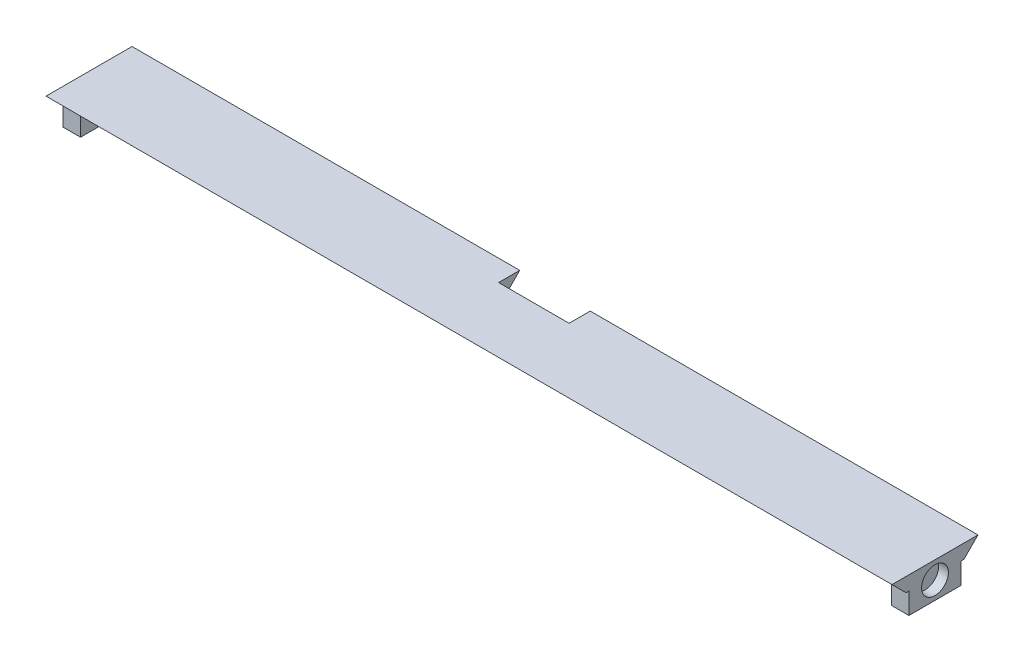
ISO-10303-21;
HEADER;
FILE_DESCRIPTION(('STEP AP214'),'2;1');
FILE_NAME('part.step','',(''),(''),'','','');
FILE_SCHEMA(('AUTOMOTIVE_DESIGN { 1 0 10303 214 1 1 1 1 }'));
ENDSEC;
DATA;
#1=APPLICATION_CONTEXT('core data for automotive mechanical design processes');
#2=APPLICATION_PROTOCOL_DEFINITION('international standard','automotive_design',2000,#1);
#3=PRODUCT_CONTEXT('',#1,'mechanical');
#4=PRODUCT('Part','Part','',(#3));
#5=PRODUCT_RELATED_PRODUCT_CATEGORY('part','',(#4));
#6=PRODUCT_DEFINITION_FORMATION('','',#4);
#7=PRODUCT_DEFINITION_CONTEXT('part definition',#1,'design');
#8=PRODUCT_DEFINITION('design','',#6,#7);
#9=PRODUCT_DEFINITION_SHAPE('','',#8);
#10=(LENGTH_UNIT() NAMED_UNIT(*) SI_UNIT(.MILLI.,.METRE.));
#11=(NAMED_UNIT(*) PLANE_ANGLE_UNIT() SI_UNIT($,.RADIAN.));
#12=(NAMED_UNIT(*) SI_UNIT($,.STERADIAN.) SOLID_ANGLE_UNIT());
#13=UNCERTAINTY_MEASURE_WITH_UNIT(LENGTH_MEASURE(1.E-05),#10,'distance_accuracy_value','');
#14=(GEOMETRIC_REPRESENTATION_CONTEXT(3) GLOBAL_UNCERTAINTY_ASSIGNED_CONTEXT((#13)) GLOBAL_UNIT_ASSIGNED_CONTEXT((#10,
#11,#12)) REPRESENTATION_CONTEXT('',''));
#15=CARTESIAN_POINT('',(0.,0.,0.));
#16=DIRECTION('',(0.,0.,1.));
#17=DIRECTION('',(1.,0.,0.));
#18=AXIS2_PLACEMENT_3D('',#15,#16,#17);
#19=CARTESIAN_POINT('',(0.,0.,0.));
#20=DIRECTION('',(0.,1.,0.));
#21=DIRECTION('',(0.,0.,1.));
#22=AXIS2_PLACEMENT_3D('',#19,#20,#21);
#23=PLANE('',#22);
#24=DIRECTION('',(1.,0.,0.));
#25=VECTOR('',#24,1.);
#26=CARTESIAN_POINT('',(0.,0.,-9.8));
#27=LINE('',#26,#25);
#28=CARTESIAN_POINT('',(0.,0.,-9.8));
#29=VERTEX_POINT('',#28);
#30=CARTESIAN_POINT('',(2.5,0.,-9.8));
#31=VERTEX_POINT('',#30);
#32=EDGE_CURVE('E482',#29,#31,#27,.T.);
#33=ORIENTED_EDGE('',*,*,#32,.F.);
#34=DIRECTION('',(0.,0.,-1.));
#35=VECTOR('',#34,1.);
#36=CARTESIAN_POINT('',(0.,0.,0.));
#37=LINE('',#36,#35);
#38=CARTESIAN_POINT('',(0.,0.,-10.2));
#39=VERTEX_POINT('',#38);
#40=EDGE_CURVE('E178',#29,#39,#37,.T.);
#41=ORIENTED_EDGE('',*,*,#40,.T.);
#42=DIRECTION('',(1.,0.,0.));
#43=VECTOR('',#42,1.);
#44=CARTESIAN_POINT('',(55.,0.,-10.2));
#45=LINE('',#44,#43);
#46=CARTESIAN_POINT('',(55.,0.,-10.2));
#47=VERTEX_POINT('',#46);
#48=EDGE_CURVE('E255',#39,#47,#45,.T.);
#49=ORIENTED_EDGE('',*,*,#48,.T.);
#50=DIRECTION('',(0.,0.,-1.));
#51=VECTOR('',#50,1.);
#52=CARTESIAN_POINT('',(55.,0.,1.27213054904966E-13));
#53=LINE('',#52,#51);
#54=CARTESIAN_POINT('',(55.,0.,-7.19999999999999));
#55=VERTEX_POINT('',#54);
#56=EDGE_CURVE('E214',#55,#47,#53,.T.);
#57=ORIENTED_EDGE('',*,*,#56,.F.);
#58=DIRECTION('',(1.,0.,0.));
#59=VECTOR('',#58,1.);
#60=CARTESIAN_POINT('',(0.,0.,-7.19999999999998));
#61=LINE('',#60,#59);
#62=CARTESIAN_POINT('',(65.,0.,-7.2));
#63=VERTEX_POINT('',#62);
#64=EDGE_CURVE('E252',#55,#63,#61,.T.);
#65=ORIENTED_EDGE('',*,*,#64,.T.);
#66=DIRECTION('',(0.,0.,-1.));
#67=VECTOR('',#66,1.);
#68=CARTESIAN_POINT('',(65.,0.,-3.00685402502647E-13));
#69=LINE('',#68,#67);
#70=CARTESIAN_POINT('',(65.,0.,-10.2));
#71=VERTEX_POINT('',#70);
#72=EDGE_CURVE('E219',#63,#71,#69,.T.);
#73=ORIENTED_EDGE('',*,*,#72,.T.);
#74=DIRECTION('',(1.,0.,0.));
#75=VECTOR('',#74,1.);
#76=CARTESIAN_POINT('',(120.,0.,-10.2));
#77=LINE('',#76,#75);
#78=CARTESIAN_POINT('',(120.,0.,-10.2));
#79=VERTEX_POINT('',#78);
#80=EDGE_CURVE('E258',#71,#79,#77,.T.);
#81=ORIENTED_EDGE('',*,*,#80,.T.);
#82=DIRECTION('',(0.,0.,-1.));
#83=VECTOR('',#82,1.);
#84=CARTESIAN_POINT('',(120.,0.,-1.36502830896535E-13));
#85=LINE('',#84,#83);
#86=CARTESIAN_POINT('',(120.,0.,-9.8));
#87=VERTEX_POINT('',#86);
#88=EDGE_CURVE('E243',#87,#79,#85,.T.);
#89=ORIENTED_EDGE('',*,*,#88,.F.);
#90=DIRECTION('',(1.,0.,0.));
#91=VECTOR('',#90,1.);
#92=CARTESIAN_POINT('',(120.,0.,-9.8));
#93=LINE('',#92,#91);
#94=CARTESIAN_POINT('',(117.5,0.,-9.8));
#95=VERTEX_POINT('',#94);
#96=EDGE_CURVE('E192',#95,#87,#93,.T.);
#97=ORIENTED_EDGE('',*,*,#96,.F.);
#98=DIRECTION('',(0.,0.,-1.));
#99=VECTOR('',#98,1.);
#100=CARTESIAN_POINT('',(117.5,0.,-2.4));
#101=LINE('',#100,#99);
#102=CARTESIAN_POINT('',(117.5,0.,-2.4));
#103=VERTEX_POINT('',#102);
#104=EDGE_CURVE('E182',#103,#95,#101,.T.);
#105=ORIENTED_EDGE('',*,*,#104,.F.);
#106=DIRECTION('',(-1.,0.,0.));
#107=VECTOR('',#106,1.);
#108=CARTESIAN_POINT('',(120.,0.,-2.4));
#109=LINE('',#108,#107);
#110=CARTESIAN_POINT('',(120.,0.,-2.4));
#111=VERTEX_POINT('',#110);
#112=EDGE_CURVE('E179',#111,#103,#109,.T.);
#113=ORIENTED_EDGE('',*,*,#112,.F.);
#114=CARTESIAN_POINT('',(120.,0.,-2.));
#115=VERTEX_POINT('',#114);
#116=EDGE_CURVE('E244',#115,#111,#85,.T.);
#117=ORIENTED_EDGE('',*,*,#116,.F.);
#118=DIRECTION('',(-1.,0.,0.));
#119=VECTOR('',#118,1.);
#120=CARTESIAN_POINT('',(0.,0.,-2.));
#121=LINE('',#120,#119);
#122=CARTESIAN_POINT('',(0.,0.,-2.));
#123=VERTEX_POINT('',#122);
#124=EDGE_CURVE('E261',#115,#123,#121,.T.);
#125=ORIENTED_EDGE('',*,*,#124,.T.);
#126=CARTESIAN_POINT('',(0.,0.,-2.4));
#127=VERTEX_POINT('',#126);
#128=EDGE_CURVE('E241',#123,#127,#37,.T.);
#129=ORIENTED_EDGE('',*,*,#128,.T.);
#130=DIRECTION('',(-1.,0.,0.));
#131=VECTOR('',#130,1.);
#132=CARTESIAN_POINT('',(0.,0.,-2.4));
#133=LINE('',#132,#131);
#134=CARTESIAN_POINT('',(2.5,0.,-2.4));
#135=VERTEX_POINT('',#134);
#136=EDGE_CURVE('E64',#135,#127,#133,.T.);
#137=ORIENTED_EDGE('',*,*,#136,.F.);
#138=DIRECTION('',(0.,0.,1.));
#139=VECTOR('',#138,1.);
#140=CARTESIAN_POINT('',(2.5,0.,-2.4));
#141=LINE('',#140,#139);
#142=EDGE_CURVE('E59',#31,#135,#141,.T.);
#143=ORIENTED_EDGE('',*,*,#142,.F.);
#144=EDGE_LOOP('',(#33,#41,#49,#57,#65,#73,#81,#89,#97,#105,#113,#117,#125,#129,#137,#143));
#145=FACE_BOUND('',#144,.T.);
#146=ADVANCED_FACE('F43',(#145),#23,.F.);
#147=CARTESIAN_POINT('',(55.,2.,1.27213054904966E-13));
#148=DIRECTION('',(-1.,0.,0.));
#149=DIRECTION('',(0.,0.,1.));
#150=AXIS2_PLACEMENT_3D('',#147,#148,#149);
#151=PLANE('',#150);
#152=ORIENTED_EDGE('',*,*,#56,.T.);
#153=DIRECTION('',(0.,0.707106781186547,-0.707106781186548));
#154=VECTOR('',#153,1.);
#155=CARTESIAN_POINT('',(55.,0.,-10.1999999999999));
#156=LINE('',#155,#154);
#157=CARTESIAN_POINT('',(55.,2.,-12.2));
#158=VERTEX_POINT('',#157);
#159=EDGE_CURVE('E269',#47,#158,#156,.T.);
#160=ORIENTED_EDGE('',*,*,#159,.T.);
#161=DIRECTION('',(0.,0.,-1.));
#162=VECTOR('',#161,1.);
#163=CARTESIAN_POINT('',(55.,2.,1.27213054904966E-13));
#164=LINE('',#163,#162);
#165=CARTESIAN_POINT('',(55.,2.,-9.2));
#166=VERTEX_POINT('',#165);
#167=EDGE_CURVE('E218',#166,#158,#164,.T.);
#168=ORIENTED_EDGE('',*,*,#167,.F.);
#169=DIRECTION('',(0.,0.707106781186547,-0.707106781186548));
#170=VECTOR('',#169,1.);
#171=CARTESIAN_POINT('',(55.,-2.60000000000006,-4.59999999999993));
#172=LINE('',#171,#170);
#173=EDGE_CURVE('E52',#166,#55,#172,.F.);
#174=ORIENTED_EDGE('',*,*,#173,.T.);
#175=EDGE_LOOP('',(#152,#160,#168,#174));
#176=FACE_BOUND('',#175,.T.);
#177=ADVANCED_FACE('F274',(#176),#151,.F.);
#178=CARTESIAN_POINT('',(0.,2.,0.));
#179=DIRECTION('',(-1.,0.,0.));
#180=DIRECTION('',(0.,0.,1.));
#181=AXIS2_PLACEMENT_3D('',#178,#179,#180);
#182=PLANE('',#181);
#183=CARTESIAN_POINT('',(0.,-0.5,-6.1));
#184=DIRECTION('',(-1.,0.,0.));
#185=DIRECTION('',(0.,0.,1.));
#186=AXIS2_PLACEMENT_3D('',#183,#184,#185);
#187=CIRCLE('',#186,1.9);
#188=CARTESIAN_POINT('',(0.,-0.5,-4.2));
#189=VERTEX_POINT('',#188);
#190=EDGE_CURVE('E472',#189,#189,#187,.T.);
#191=ORIENTED_EDGE('',*,*,#190,.F.);
#192=EDGE_LOOP('',(#191));
#193=FACE_BOUND('',#192,.T.);
#194=ORIENTED_EDGE('',*,*,#128,.F.);
#195=DIRECTION('',(0.,-0.707106781186547,-0.707106781186548));
#196=VECTOR('',#195,1.);
#197=CARTESIAN_POINT('',(0.,2.,0.));
#198=LINE('',#197,#196);
#199=CARTESIAN_POINT('',(0.,2.,0.));
#200=VERTEX_POINT('',#199);
#201=EDGE_CURVE('E265',#123,#200,#198,.F.);
#202=ORIENTED_EDGE('',*,*,#201,.T.);
#203=DIRECTION('',(0.,0.,-1.));
#204=VECTOR('',#203,1.);
#205=CARTESIAN_POINT('',(0.,2.,0.));
#206=LINE('',#205,#204);
#207=CARTESIAN_POINT('',(0.,2.,-12.2));
#208=VERTEX_POINT('',#207);
#209=EDGE_CURVE('E225',#200,#208,#206,.T.);
#210=ORIENTED_EDGE('',*,*,#209,.T.);
#211=DIRECTION('',(0.,-0.707106781186547,0.707106781186548));
#212=VECTOR('',#211,1.);
#213=CARTESIAN_POINT('',(0.,-4.1,-6.1));
#214=LINE('',#213,#212);
#215=EDGE_CURVE('E263',#208,#39,#214,.T.);
#216=ORIENTED_EDGE('',*,*,#215,.T.);
#217=ORIENTED_EDGE('',*,*,#40,.F.);
#218=DIRECTION('',(0.,1.,0.));
#219=VECTOR('',#218,1.);
#220=CARTESIAN_POINT('',(0.,-3.,-9.8));
#221=LINE('',#220,#219);
#222=CARTESIAN_POINT('',(0.,-3.,-9.8));
#223=VERTEX_POINT('',#222);
#224=EDGE_CURVE('E159',#223,#29,#221,.T.);
#225=ORIENTED_EDGE('',*,*,#224,.F.);
#226=DIRECTION('',(0.,0.,-1.));
#227=VECTOR('',#226,1.);
#228=CARTESIAN_POINT('',(0.,-3.,-2.4));
#229=LINE('',#228,#227);
#230=CARTESIAN_POINT('',(0.,-3.,-2.4));
#231=VERTEX_POINT('',#230);
#232=EDGE_CURVE('E165',#231,#223,#229,.T.);
#233=ORIENTED_EDGE('',*,*,#232,.F.);
#234=DIRECTION('',(0.,1.,0.));
#235=VECTOR('',#234,1.);
#236=CARTESIAN_POINT('',(0.,-3.,-2.4));
#237=LINE('',#236,#235);
#238=EDGE_CURVE('E486',#231,#127,#237,.T.);
#239=ORIENTED_EDGE('',*,*,#238,.T.);
#240=EDGE_LOOP('',(#194,#202,#210,#216,#217,#225,#233,#239));
#241=FACE_BOUND('',#240,.T.);
#242=ADVANCED_FACE('F176',(#193,#241),#182,.T.);
#243=CARTESIAN_POINT('',(120.,2.,-1.36502830896535E-13));
#244=DIRECTION('',(-1.,0.,0.));
#245=DIRECTION('',(0.,0.,1.));
#246=AXIS2_PLACEMENT_3D('',#243,#244,#245);
#247=PLANE('',#246);
#248=CARTESIAN_POINT('',(120.,-0.5,-6.10000000000003));
#249=DIRECTION('',(1.,0.,0.));
#250=DIRECTION('',(0.,0.,-1.));
#251=AXIS2_PLACEMENT_3D('',#248,#249,#250);
#252=CIRCLE('',#251,1.9);
#253=CARTESIAN_POINT('',(120.,-0.5,-8.00000000000003));
#254=VERTEX_POINT('',#253);
#255=EDGE_CURVE('E473',#254,#254,#252,.T.);
#256=ORIENTED_EDGE('',*,*,#255,.F.);
#257=EDGE_LOOP('',(#256));
#258=FACE_BOUND('',#257,.T.);
#259=DIRECTION('',(0.,0.,-1.));
#260=VECTOR('',#259,1.);
#261=CARTESIAN_POINT('',(120.,2.,-1.36502830896535E-13));
#262=LINE('',#261,#260);
#263=CARTESIAN_POINT('',(120.,2.,0.));
#264=VERTEX_POINT('',#263);
#265=CARTESIAN_POINT('',(120.,2.,-12.2000000000001));
#266=VERTEX_POINT('',#265);
#267=EDGE_CURVE('E232',#264,#266,#262,.T.);
#268=ORIENTED_EDGE('',*,*,#267,.F.);
#269=DIRECTION('',(0.,0.707106781186547,0.707106781186548));
#270=VECTOR('',#269,1.);
#271=CARTESIAN_POINT('',(120.,1.99999999999993,0.));
#272=LINE('',#271,#270);
#273=EDGE_CURVE('E250',#264,#115,#272,.F.);
#274=ORIENTED_EDGE('',*,*,#273,.T.);
#275=ORIENTED_EDGE('',*,*,#116,.T.);
#276=DIRECTION('',(0.,1.,0.));
#277=VECTOR('',#276,1.);
#278=CARTESIAN_POINT('',(120.,-3.,-2.4));
#279=LINE('',#278,#277);
#280=CARTESIAN_POINT('',(120.,-3.,-2.4));
#281=VERTEX_POINT('',#280);
#282=EDGE_CURVE('E211',#281,#111,#279,.T.);
#283=ORIENTED_EDGE('',*,*,#282,.F.);
#284=DIRECTION('',(0.,0.,1.));
#285=VECTOR('',#284,1.);
#286=CARTESIAN_POINT('',(120.,-3.,-2.4));
#287=LINE('',#286,#285);
#288=CARTESIAN_POINT('',(120.,-3.,-9.8));
#289=VERTEX_POINT('',#288);
#290=EDGE_CURVE('E188',#289,#281,#287,.T.);
#291=ORIENTED_EDGE('',*,*,#290,.F.);
#292=DIRECTION('',(0.,1.,0.));
#293=VECTOR('',#292,1.);
#294=CARTESIAN_POINT('',(120.,-3.,-9.8));
#295=LINE('',#294,#293);
#296=EDGE_CURVE('E197',#289,#87,#295,.T.);
#297=ORIENTED_EDGE('',*,*,#296,.T.);
#298=ORIENTED_EDGE('',*,*,#88,.T.);
#299=DIRECTION('',(0.,0.707106781186547,-0.707106781186548));
#300=VECTOR('',#299,1.);
#301=CARTESIAN_POINT('',(120.,0.,-10.2000000000001));
#302=LINE('',#301,#300);
#303=EDGE_CURVE('E238',#79,#266,#302,.T.);
#304=ORIENTED_EDGE('',*,*,#303,.T.);
#305=EDGE_LOOP('',(#268,#274,#275,#283,#291,#297,#298,#304));
#306=FACE_BOUND('',#305,.T.);
#307=ADVANCED_FACE('F302',(#258,#306),#247,.F.);
#308=CARTESIAN_POINT('',(65.,2.,-3.00685402502647E-13));
#309=DIRECTION('',(-1.,0.,0.));
#310=DIRECTION('',(0.,0.,1.));
#311=AXIS2_PLACEMENT_3D('',#308,#309,#310);
#312=PLANE('',#311);
#313=DIRECTION('',(0.,0.,-1.));
#314=VECTOR('',#313,1.);
#315=CARTESIAN_POINT('',(65.,2.,-3.00685402502647E-13));
#316=LINE('',#315,#314);
#317=CARTESIAN_POINT('',(65.,2.,-9.2));
#318=VERTEX_POINT('',#317);
#319=CARTESIAN_POINT('',(65.,2.,-12.2));
#320=VERTEX_POINT('',#319);
#321=EDGE_CURVE('E235',#318,#320,#316,.T.);
#322=ORIENTED_EDGE('',*,*,#321,.T.);
#323=DIRECTION('',(0.,-0.707106781186547,0.707106781186548));
#324=VECTOR('',#323,1.);
#325=CARTESIAN_POINT('',(65.,-4.09999999999986,-6.10000000000016));
#326=LINE('',#325,#324);
#327=EDGE_CURVE('E267',#320,#71,#326,.T.);
#328=ORIENTED_EDGE('',*,*,#327,.T.);
#329=ORIENTED_EDGE('',*,*,#72,.F.);
#330=DIRECTION('',(0.,-0.707106781186547,0.707106781186548));
#331=VECTOR('',#330,1.);
#332=CARTESIAN_POINT('',(65.,2.00000000000014,-9.20000000000014));
#333=LINE('',#332,#331);
#334=EDGE_CURVE('E11',#63,#318,#333,.F.);
#335=ORIENTED_EDGE('',*,*,#334,.T.);
#336=EDGE_LOOP('',(#322,#328,#329,#335));
#337=FACE_BOUND('',#336,.T.);
#338=ADVANCED_FACE('F290',(#337),#312,.T.);
#339=CARTESIAN_POINT('',(0.,2.,0.));
#340=DIRECTION('',(0.,1.,0.));
#341=DIRECTION('',(0.,0.,1.));
#342=AXIS2_PLACEMENT_3D('',#339,#340,#341);
#343=PLANE('',#342);
#344=DIRECTION('',(-1.,0.,0.));
#345=VECTOR('',#344,1.);
#346=CARTESIAN_POINT('',(0.,2.,-9.19999999999998));
#347=LINE('',#346,#345);
#348=EDGE_CURVE('E215',#318,#166,#347,.T.);
#349=ORIENTED_EDGE('',*,*,#348,.T.);
#350=ORIENTED_EDGE('',*,*,#167,.T.);
#351=DIRECTION('',(1.,0.,0.));
#352=VECTOR('',#351,1.);
#353=CARTESIAN_POINT('',(0.,2.,-12.2));
#354=LINE('',#353,#352);
#355=EDGE_CURVE('E222',#208,#158,#354,.T.);
#356=ORIENTED_EDGE('',*,*,#355,.F.);
#357=ORIENTED_EDGE('',*,*,#209,.F.);
#358=DIRECTION('',(1.,0.,0.));
#359=VECTOR('',#358,1.);
#360=CARTESIAN_POINT('',(0.,2.,0.));
#361=LINE('',#360,#359);
#362=EDGE_CURVE('E229',#200,#264,#361,.T.);
#363=ORIENTED_EDGE('',*,*,#362,.T.);
#364=ORIENTED_EDGE('',*,*,#267,.T.);
#365=EDGE_CURVE('E226',#320,#266,#354,.T.);
#366=ORIENTED_EDGE('',*,*,#365,.F.);
#367=ORIENTED_EDGE('',*,*,#321,.F.);
#368=EDGE_LOOP('',(#349,#350,#356,#357,#363,#364,#366,#367));
#369=FACE_BOUND('',#368,.T.);
#370=ADVANCED_FACE('F284',(#369),#343,.T.);
#371=CARTESIAN_POINT('',(0.,2.,0.));
#372=DIRECTION('',(0.,0.707106781186548,-0.707106781186547));
#373=DIRECTION('',(1.,0.,0.));
#374=AXIS2_PLACEMENT_3D('',#371,#372,#373);
#375=PLANE('',#374);
#376=ORIENTED_EDGE('',*,*,#201,.F.);
#377=ORIENTED_EDGE('',*,*,#124,.F.);
#378=ORIENTED_EDGE('',*,*,#273,.F.);
#379=ORIENTED_EDGE('',*,*,#362,.F.);
#380=EDGE_LOOP('',(#376,#377,#378,#379));
#381=FACE_BOUND('',#380,.T.);
#382=ADVANCED_FACE('F337',(#381),#375,.F.);
#383=CARTESIAN_POINT('',(0.,0.,-10.2));
#384=DIRECTION('',(0.,-0.707106781186548,-0.707106781186547));
#385=DIRECTION('',(-1.,0.,0.));
#386=AXIS2_PLACEMENT_3D('',#383,#384,#385);
#387=PLANE('',#386);
#388=ORIENTED_EDGE('',*,*,#327,.F.);
#389=ORIENTED_EDGE('',*,*,#365,.T.);
#390=ORIENTED_EDGE('',*,*,#303,.F.);
#391=ORIENTED_EDGE('',*,*,#80,.F.);
#392=EDGE_LOOP('',(#388,#389,#390,#391));
#393=FACE_BOUND('',#392,.T.);
#394=ADVANCED_FACE('F292',(#393),#387,.T.);
#395=CARTESIAN_POINT('',(0.,0.,-10.2));
#396=DIRECTION('',(0.,-0.707106781186548,-0.707106781186547));
#397=DIRECTION('',(-1.,0.,0.));
#398=AXIS2_PLACEMENT_3D('',#395,#396,#397);
#399=PLANE('',#398);
#400=ORIENTED_EDGE('',*,*,#215,.F.);
#401=ORIENTED_EDGE('',*,*,#355,.T.);
#402=ORIENTED_EDGE('',*,*,#159,.F.);
#403=ORIENTED_EDGE('',*,*,#48,.F.);
#404=EDGE_LOOP('',(#400,#401,#402,#403));
#405=FACE_BOUND('',#404,.T.);
#406=ADVANCED_FACE('F282',(#405),#399,.T.);
#407=CARTESIAN_POINT('',(0.,2.,-9.19999999999998));
#408=DIRECTION('',(0.,0.707106781186548,0.707106781186547));
#409=DIRECTION('',(-1.,0.,0.));
#410=AXIS2_PLACEMENT_3D('',#407,#408,#409);
#411=PLANE('',#410);
#412=ORIENTED_EDGE('',*,*,#334,.F.);
#413=ORIENTED_EDGE('',*,*,#64,.F.);
#414=ORIENTED_EDGE('',*,*,#173,.F.);
#415=ORIENTED_EDGE('',*,*,#348,.F.);
#416=EDGE_LOOP('',(#412,#413,#414,#415));
#417=FACE_BOUND('',#416,.T.);
#418=ADVANCED_FACE('F46',(#417),#411,.F.);
#419=CARTESIAN_POINT('',(120.,-3.,-2.4));
#420=DIRECTION('',(0.,0.,-1.));
#421=DIRECTION('',(-1.,0.,0.));
#422=AXIS2_PLACEMENT_3D('',#419,#420,#421);
#423=PLANE('',#422);
#424=ORIENTED_EDGE('',*,*,#112,.T.);
#425=DIRECTION('',(0.,1.,0.));
#426=VECTOR('',#425,1.);
#427=CARTESIAN_POINT('',(117.5,-3.,-2.4));
#428=LINE('',#427,#426);
#429=CARTESIAN_POINT('',(117.5,-3.,-2.4));
#430=VERTEX_POINT('',#429);
#431=EDGE_CURVE('E208',#430,#103,#428,.T.);
#432=ORIENTED_EDGE('',*,*,#431,.F.);
#433=DIRECTION('',(-1.,0.,0.));
#434=VECTOR('',#433,1.);
#435=CARTESIAN_POINT('',(120.,-3.,-2.4));
#436=LINE('',#435,#434);
#437=EDGE_CURVE('E191',#281,#430,#436,.T.);
#438=ORIENTED_EDGE('',*,*,#437,.F.);
#439=ORIENTED_EDGE('',*,*,#282,.T.);
#440=EDGE_LOOP('',(#424,#432,#438,#439));
#441=FACE_BOUND('',#440,.T.);
#442=ADVANCED_FACE('F312',(#441),#423,.F.);
#443=CARTESIAN_POINT('',(117.5,-3.,-2.4));
#444=DIRECTION('',(1.,0.,0.));
#445=DIRECTION('',(0.,0.,-1.));
#446=AXIS2_PLACEMENT_3D('',#443,#444,#445);
#447=PLANE('',#446);
#448=ORIENTED_EDGE('',*,*,#104,.T.);
#449=DIRECTION('',(0.,1.,0.));
#450=VECTOR('',#449,1.);
#451=CARTESIAN_POINT('',(117.5,-3.,-9.8));
#452=LINE('',#451,#450);
#453=CARTESIAN_POINT('',(117.5,-3.,-9.8));
#454=VERTEX_POINT('',#453);
#455=EDGE_CURVE('E205',#454,#95,#452,.T.);
#456=ORIENTED_EDGE('',*,*,#455,.F.);
#457=DIRECTION('',(0.,0.,-1.));
#458=VECTOR('',#457,1.);
#459=CARTESIAN_POINT('',(117.5,-3.,-2.4));
#460=LINE('',#459,#458);
#461=EDGE_CURVE('E194',#430,#454,#460,.T.);
#462=ORIENTED_EDGE('',*,*,#461,.F.);
#463=ORIENTED_EDGE('',*,*,#431,.T.);
#464=EDGE_LOOP('',(#448,#456,#462,#463));
#465=FACE_BOUND('',#464,.T.);
#466=ADVANCED_FACE('F309',(#465),#447,.F.);
#467=CARTESIAN_POINT('',(120.,-3.,-9.8));
#468=DIRECTION('',(0.,0.,1.));
#469=DIRECTION('',(1.,0.,0.));
#470=AXIS2_PLACEMENT_3D('',#467,#468,#469);
#471=PLANE('',#470);
#472=ORIENTED_EDGE('',*,*,#96,.T.);
#473=ORIENTED_EDGE('',*,*,#296,.F.);
#474=DIRECTION('',(1.,0.,0.));
#475=VECTOR('',#474,1.);
#476=CARTESIAN_POINT('',(120.,-3.,-9.8));
#477=LINE('',#476,#475);
#478=EDGE_CURVE('E196',#454,#289,#477,.T.);
#479=ORIENTED_EDGE('',*,*,#478,.F.);
#480=ORIENTED_EDGE('',*,*,#455,.T.);
#481=EDGE_LOOP('',(#472,#473,#479,#480));
#482=FACE_BOUND('',#481,.T.);
#483=ADVANCED_FACE('F297',(#482),#471,.F.);
#484=CARTESIAN_POINT('',(0.,-3.,0.));
#485=DIRECTION('',(0.,1.,0.));
#486=DIRECTION('',(0.,0.,1.));
#487=AXIS2_PLACEMENT_3D('',#484,#485,#486);
#488=PLANE('',#487);
#489=ORIENTED_EDGE('',*,*,#290,.T.);
#490=ORIENTED_EDGE('',*,*,#437,.T.);
#491=ORIENTED_EDGE('',*,*,#461,.T.);
#492=ORIENTED_EDGE('',*,*,#478,.T.);
#493=EDGE_LOOP('',(#489,#490,#491,#492));
#494=FACE_BOUND('',#493,.T.);
#495=ADVANCED_FACE('F305',(#494),#488,.F.);
#496=CARTESIAN_POINT('',(0.,-3.,-9.8));
#497=DIRECTION('',(0.,0.,1.));
#498=DIRECTION('',(1.,0.,0.));
#499=AXIS2_PLACEMENT_3D('',#496,#497,#498);
#500=PLANE('',#499);
#501=ORIENTED_EDGE('',*,*,#32,.T.);
#502=DIRECTION('',(0.,1.,0.));
#503=VECTOR('',#502,1.);
#504=CARTESIAN_POINT('',(2.5,-3.,-9.8));
#505=LINE('',#504,#503);
#506=CARTESIAN_POINT('',(2.5,-3.,-9.8));
#507=VERTEX_POINT('',#506);
#508=EDGE_CURVE('E161',#507,#31,#505,.T.);
#509=ORIENTED_EDGE('',*,*,#508,.F.);
#510=DIRECTION('',(1.,0.,0.));
#511=VECTOR('',#510,1.);
#512=CARTESIAN_POINT('',(0.,-3.,-9.8));
#513=LINE('',#512,#511);
#514=EDGE_CURVE('E155',#223,#507,#513,.T.);
#515=ORIENTED_EDGE('',*,*,#514,.F.);
#516=ORIENTED_EDGE('',*,*,#224,.T.);
#517=EDGE_LOOP('',(#501,#509,#515,#516));
#518=FACE_BOUND('',#517,.T.);
#519=ADVANCED_FACE('F157',(#518),#500,.F.);
#520=CARTESIAN_POINT('',(2.5,-3.,-2.4));
#521=DIRECTION('',(-1.,0.,0.));
#522=DIRECTION('',(0.,0.,1.));
#523=AXIS2_PLACEMENT_3D('',#520,#521,#522);
#524=PLANE('',#523);
#525=ORIENTED_EDGE('',*,*,#142,.T.);
#526=DIRECTION('',(0.,1.,0.));
#527=VECTOR('',#526,1.);
#528=CARTESIAN_POINT('',(2.5,-3.,-2.4));
#529=LINE('',#528,#527);
#530=CARTESIAN_POINT('',(2.5,-3.,-2.4));
#531=VERTEX_POINT('',#530);
#532=EDGE_CURVE('E184',#531,#135,#529,.T.);
#533=ORIENTED_EDGE('',*,*,#532,.F.);
#534=DIRECTION('',(0.,0.,1.));
#535=VECTOR('',#534,1.);
#536=CARTESIAN_POINT('',(2.5,-3.,-2.4));
#537=LINE('',#536,#535);
#538=EDGE_CURVE('E164',#507,#531,#537,.T.);
#539=ORIENTED_EDGE('',*,*,#538,.F.);
#540=ORIENTED_EDGE('',*,*,#508,.T.);
#541=EDGE_LOOP('',(#525,#533,#539,#540));
#542=FACE_BOUND('',#541,.T.);
#543=ADVANCED_FACE('F412',(#542),#524,.F.);
#544=CARTESIAN_POINT('',(0.,-3.,-2.4));
#545=DIRECTION('',(0.,0.,-1.));
#546=DIRECTION('',(-1.,0.,0.));
#547=AXIS2_PLACEMENT_3D('',#544,#545,#546);
#548=PLANE('',#547);
#549=ORIENTED_EDGE('',*,*,#136,.T.);
#550=ORIENTED_EDGE('',*,*,#238,.F.);
#551=DIRECTION('',(-1.,0.,0.));
#552=VECTOR('',#551,1.);
#553=CARTESIAN_POINT('',(0.,-3.,-2.4));
#554=LINE('',#553,#552);
#555=EDGE_CURVE('E170',#531,#231,#554,.T.);
#556=ORIENTED_EDGE('',*,*,#555,.F.);
#557=ORIENTED_EDGE('',*,*,#532,.T.);
#558=EDGE_LOOP('',(#549,#550,#556,#557));
#559=FACE_BOUND('',#558,.T.);
#560=ADVANCED_FACE('F419',(#559),#548,.F.);
#561=CARTESIAN_POINT('',(0.,-3.,0.));
#562=DIRECTION('',(0.,-1.,0.));
#563=DIRECTION('',(0.,0.,-1.));
#564=AXIS2_PLACEMENT_3D('',#561,#562,#563);
#565=PLANE('',#564);
#566=ORIENTED_EDGE('',*,*,#232,.T.);
#567=ORIENTED_EDGE('',*,*,#514,.T.);
#568=ORIENTED_EDGE('',*,*,#538,.T.);
#569=ORIENTED_EDGE('',*,*,#555,.T.);
#570=EDGE_LOOP('',(#566,#567,#568,#569));
#571=FACE_BOUND('',#570,.T.);
#572=ADVANCED_FACE('F168',(#571),#565,.T.);
#573=CARTESIAN_POINT('',(1.4,-0.5,-6.1));
#574=DIRECTION('',(-1.,0.,0.));
#575=DIRECTION('',(0.,0.,1.));
#576=AXIS2_PLACEMENT_3D('',#573,#574,#575);
#577=CYLINDRICAL_SURFACE('',#576,1.9);
#578=CARTESIAN_POINT('',(1.4,-0.5,-6.1));
#579=DIRECTION('',(-1.,0.,0.));
#580=DIRECTION('',(0.,0.,1.));
#581=AXIS2_PLACEMENT_3D('',#578,#579,#580);
#582=CIRCLE('',#581,1.9);
#583=CARTESIAN_POINT('',(1.4,-0.5,-4.2));
#584=VERTEX_POINT('',#583);
#585=EDGE_CURVE('E476',#584,#584,#582,.T.);
#586=ORIENTED_EDGE('',*,*,#585,.F.);
#587=EDGE_LOOP('',(#586));
#588=FACE_BOUND('',#587,.T.);
#589=ORIENTED_EDGE('',*,*,#190,.T.);
#590=EDGE_LOOP('',(#589));
#591=FACE_BOUND('',#590,.T.);
#592=ADVANCED_FACE('F433',(#588,#591),#577,.F.);
#593=CARTESIAN_POINT('',(1.4,0.,0.));
#594=DIRECTION('',(-1.,0.,0.));
#595=DIRECTION('',(0.,0.,1.));
#596=AXIS2_PLACEMENT_3D('',#593,#594,#595);
#597=PLANE('',#596);
#598=ORIENTED_EDGE('',*,*,#585,.T.);
#599=EDGE_LOOP('',(#598));
#600=FACE_BOUND('',#599,.T.);
#601=ADVANCED_FACE('F439',(#600),#597,.T.);
#602=CARTESIAN_POINT('',(118.6,-0.5,-6.10000000000002));
#603=DIRECTION('',(1.,0.,0.));
#604=DIRECTION('',(0.,0.,-1.));
#605=AXIS2_PLACEMENT_3D('',#602,#603,#604);
#606=CYLINDRICAL_SURFACE('',#605,1.9);
#607=CARTESIAN_POINT('',(118.6,-0.5,-6.10000000000002));
#608=DIRECTION('',(1.,0.,0.));
#609=DIRECTION('',(0.,0.,-1.));
#610=AXIS2_PLACEMENT_3D('',#607,#608,#609);
#611=CIRCLE('',#610,1.9);
#612=CARTESIAN_POINT('',(118.6,-0.5,-8.00000000000002));
#613=VERTEX_POINT('',#612);
#614=EDGE_CURVE('E471',#613,#613,#611,.T.);
#615=ORIENTED_EDGE('',*,*,#614,.F.);
#616=EDGE_LOOP('',(#615));
#617=FACE_BOUND('',#616,.T.);
#618=ORIENTED_EDGE('',*,*,#255,.T.);
#619=EDGE_LOOP('',(#618));
#620=FACE_BOUND('',#619,.T.);
#621=ADVANCED_FACE('F446',(#617,#620),#606,.F.);
#622=CARTESIAN_POINT('',(118.6,0.,-1.58584766129903E-13));
#623=DIRECTION('',(1.,0.,0.));
#624=DIRECTION('',(0.,0.,-1.));
#625=AXIS2_PLACEMENT_3D('',#622,#623,#624);
#626=PLANE('',#625);
#627=ORIENTED_EDGE('',*,*,#614,.T.);
#628=EDGE_LOOP('',(#627));
#629=FACE_BOUND('',#628,.T.);
#630=ADVANCED_FACE('F456',(#629),#626,.T.);
#631=CLOSED_SHELL('',(#146,#177,#242,#307,#338,#370,#382,#394,#406,#418,#442,#466,#483,#495,
#519,#543,#560,#572,#592,#601,#621,#630));
#632=MANIFOLD_SOLID_BREP('B2',#631);
#633=ADVANCED_BREP_SHAPE_REPRESENTATION('',(#18,#632),#14);
#634=SHAPE_DEFINITION_REPRESENTATION(#9,#633);
ENDSEC;
END-ISO-10303-21;
